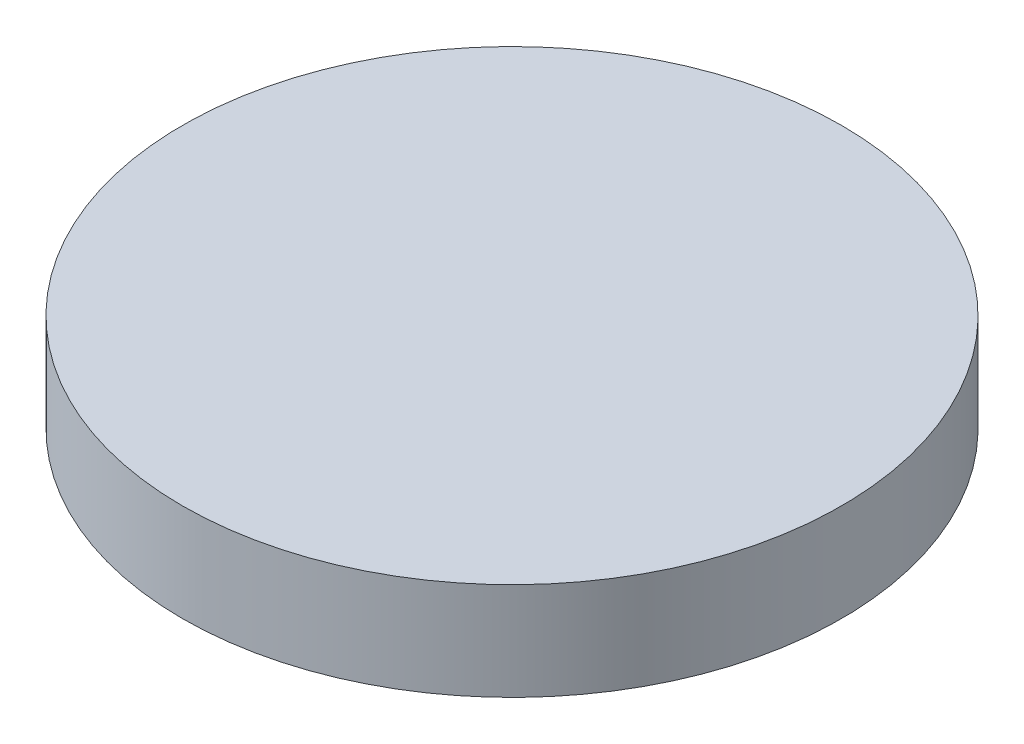
ISO-10303-21;
HEADER;
FILE_DESCRIPTION(('STEP AP214'),'2;1');
FILE_NAME('part.step','',(''),(''),'','','');
FILE_SCHEMA(('AUTOMOTIVE_DESIGN { 1 0 10303 214 1 1 1 1 }'));
ENDSEC;
DATA;
#1=APPLICATION_CONTEXT('core data for automotive mechanical design processes');
#2=APPLICATION_PROTOCOL_DEFINITION('international standard','automotive_design',2000,#1);
#3=PRODUCT_CONTEXT('',#1,'mechanical');
#4=PRODUCT('Part','Part','',(#3));
#5=PRODUCT_RELATED_PRODUCT_CATEGORY('part','',(#4));
#6=PRODUCT_DEFINITION_FORMATION('','',#4);
#7=PRODUCT_DEFINITION_CONTEXT('part definition',#1,'design');
#8=PRODUCT_DEFINITION('design','',#6,#7);
#9=PRODUCT_DEFINITION_SHAPE('','',#8);
#10=(LENGTH_UNIT() NAMED_UNIT(*) SI_UNIT(.MILLI.,.METRE.));
#11=(NAMED_UNIT(*) PLANE_ANGLE_UNIT() SI_UNIT($,.RADIAN.));
#12=(NAMED_UNIT(*) SI_UNIT($,.STERADIAN.) SOLID_ANGLE_UNIT());
#13=UNCERTAINTY_MEASURE_WITH_UNIT(LENGTH_MEASURE(1.E-05),#10,'distance_accuracy_value','');
#14=(GEOMETRIC_REPRESENTATION_CONTEXT(3) GLOBAL_UNCERTAINTY_ASSIGNED_CONTEXT((#13)) GLOBAL_UNIT_ASSIGNED_CONTEXT((#10,
#11,#12)) REPRESENTATION_CONTEXT('',''));
#15=CARTESIAN_POINT('',(0.,0.,0.));
#16=DIRECTION('',(0.,0.,1.));
#17=DIRECTION('',(1.,0.,0.));
#18=AXIS2_PLACEMENT_3D('',#15,#16,#17);
#19=CARTESIAN_POINT('',(0.,4.,0.));
#20=DIRECTION('',(0.,-1.,0.));
#21=DIRECTION('',(0.,0.,-1.));
#22=AXIS2_PLACEMENT_3D('',#19,#20,#21);
#23=CYLINDRICAL_SURFACE('',#22,13.5);
#24=CARTESIAN_POINT('',(0.,4.,0.));
#25=DIRECTION('',(0.,1.,0.));
#26=DIRECTION('',(0.,0.,1.));
#27=AXIS2_PLACEMENT_3D('',#24,#25,#26);
#28=CIRCLE('',#27,13.5);
#29=CARTESIAN_POINT('',(0.,4.,13.5));
#30=VERTEX_POINT('',#29);
#31=EDGE_CURVE('E10',#30,#30,#28,.T.);
#32=ORIENTED_EDGE('',*,*,#31,.F.);
#33=EDGE_LOOP('',(#32));
#34=FACE_BOUND('',#33,.T.);
#35=CARTESIAN_POINT('',(0.,0.,0.));
#36=DIRECTION('',(0.,1.,0.));
#37=DIRECTION('',(0.,0.,1.));
#38=AXIS2_PLACEMENT_3D('',#35,#36,#37);
#39=CIRCLE('',#38,13.5);
#40=CARTESIAN_POINT('',(0.,0.,13.5));
#41=VERTEX_POINT('',#40);
#42=EDGE_CURVE('E38',#41,#41,#39,.T.);
#43=ORIENTED_EDGE('',*,*,#42,.T.);
#44=EDGE_LOOP('',(#43));
#45=FACE_BOUND('',#44,.T.);
#46=ADVANCED_FACE('F35',(#34,#45),#23,.T.);
#47=CARTESIAN_POINT('',(0.,4.,0.));
#48=DIRECTION('',(0.,1.,0.));
#49=DIRECTION('',(0.,0.,1.));
#50=AXIS2_PLACEMENT_3D('',#47,#48,#49);
#51=PLANE('',#50);
#52=ORIENTED_EDGE('',*,*,#31,.T.);
#53=EDGE_LOOP('',(#52));
#54=FACE_BOUND('',#53,.T.);
#55=ADVANCED_FACE('F50',(#54),#51,.T.);
#56=CARTESIAN_POINT('',(0.,0.,0.));
#57=DIRECTION('',(0.,1.,0.));
#58=DIRECTION('',(0.,0.,1.));
#59=AXIS2_PLACEMENT_3D('',#56,#57,#58);
#60=PLANE('',#59);
#61=ORIENTED_EDGE('',*,*,#42,.F.);
#62=EDGE_LOOP('',(#61));
#63=FACE_BOUND('',#62,.T.);
#64=ADVANCED_FACE('F48',(#63),#60,.F.);
#65=CLOSED_SHELL('',(#46,#55,#64));
#66=MANIFOLD_SOLID_BREP('B2',#65);
#67=ADVANCED_BREP_SHAPE_REPRESENTATION('',(#18,#66),#14);
#68=SHAPE_DEFINITION_REPRESENTATION(#9,#67);
ENDSEC;
END-ISO-10303-21;
